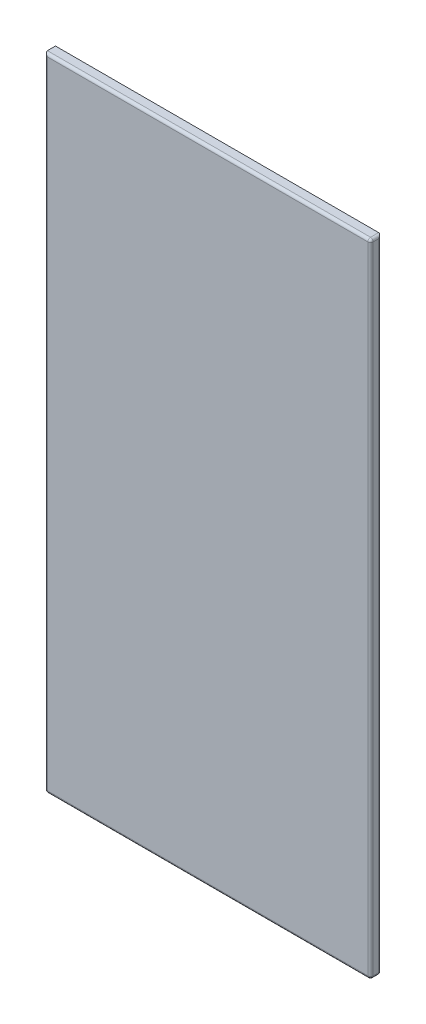
ISO-10303-21;
HEADER;
FILE_DESCRIPTION(('STEP AP214'),'2;1');
FILE_NAME('part.step','',(''),(''),'','','');
FILE_SCHEMA(('AUTOMOTIVE_DESIGN { 1 0 10303 214 1 1 1 1 }'));
ENDSEC;
DATA;
#1=APPLICATION_CONTEXT('core data for automotive mechanical design processes');
#2=APPLICATION_PROTOCOL_DEFINITION('international standard','automotive_design',2000,#1);
#3=PRODUCT_CONTEXT('',#1,'mechanical');
#4=PRODUCT('Part','Part','',(#3));
#5=PRODUCT_RELATED_PRODUCT_CATEGORY('part','',(#4));
#6=PRODUCT_DEFINITION_FORMATION('','',#4);
#7=PRODUCT_DEFINITION_CONTEXT('part definition',#1,'design');
#8=PRODUCT_DEFINITION('design','',#6,#7);
#9=PRODUCT_DEFINITION_SHAPE('','',#8);
#10=(LENGTH_UNIT() NAMED_UNIT(*) SI_UNIT(.MILLI.,.METRE.));
#11=(NAMED_UNIT(*) PLANE_ANGLE_UNIT() SI_UNIT($,.RADIAN.));
#12=(NAMED_UNIT(*) SI_UNIT($,.STERADIAN.) SOLID_ANGLE_UNIT());
#13=UNCERTAINTY_MEASURE_WITH_UNIT(LENGTH_MEASURE(1.E-05),#10,'distance_accuracy_value','');
#14=(GEOMETRIC_REPRESENTATION_CONTEXT(3) GLOBAL_UNCERTAINTY_ASSIGNED_CONTEXT((#13)) GLOBAL_UNIT_ASSIGNED_CONTEXT((#10,
#11,#12)) REPRESENTATION_CONTEXT('',''));
#15=CARTESIAN_POINT('',(0.,0.,0.));
#16=DIRECTION('',(0.,0.,1.));
#17=DIRECTION('',(1.,0.,0.));
#18=AXIS2_PLACEMENT_3D('',#15,#16,#17);
#19=CARTESIAN_POINT('',(302.5,595.,20.));
#20=DIRECTION('',(-1.,0.,0.));
#21=DIRECTION('',(0.,-1.,0.));
#22=AXIS2_PLACEMENT_3D('',#19,#20,#21);
#23=PLANE('',#22);
#24=DIRECTION('',(0.,1.,0.));
#25=VECTOR('',#24,1.);
#26=CARTESIAN_POINT('',(302.5,-595.,15.));
#27=LINE('',#26,#25);
#28=CARTESIAN_POINT('',(302.5,590.,15.));
#29=VERTEX_POINT('',#28);
#30=CARTESIAN_POINT('',(302.5,-590.,15.));
#31=VERTEX_POINT('',#30);
#32=EDGE_CURVE('E141',#29,#31,#27,.F.);
#33=ORIENTED_EDGE('',*,*,#32,.T.);
#34=DIRECTION('',(0.,0.,-1.));
#35=VECTOR('',#34,1.);
#36=CARTESIAN_POINT('',(302.5,-590.,20.));
#37=LINE('',#36,#35);
#38=CARTESIAN_POINT('',(302.5,-590.,5.));
#39=VERTEX_POINT('',#38);
#40=EDGE_CURVE('E148',#31,#39,#37,.T.);
#41=ORIENTED_EDGE('',*,*,#40,.T.);
#42=DIRECTION('',(0.,1.,0.));
#43=VECTOR('',#42,1.);
#44=CARTESIAN_POINT('',(302.5,595.,5.));
#45=LINE('',#44,#43);
#46=CARTESIAN_POINT('',(302.5,590.,5.));
#47=VERTEX_POINT('',#46);
#48=EDGE_CURVE('E144',#39,#47,#45,.T.);
#49=ORIENTED_EDGE('',*,*,#48,.T.);
#50=DIRECTION('',(0.,0.,-1.));
#51=VECTOR('',#50,1.);
#52=CARTESIAN_POINT('',(302.5,590.,20.));
#53=LINE('',#52,#51);
#54=EDGE_CURVE('E121',#47,#29,#53,.F.);
#55=ORIENTED_EDGE('',*,*,#54,.T.);
#56=EDGE_LOOP('',(#33,#41,#49,#55));
#57=FACE_BOUND('',#56,.T.);
#58=ADVANCED_FACE('F39',(#57),#23,.F.);
#59=CARTESIAN_POINT('',(-302.5,595.,20.));
#60=DIRECTION('',(0.,-1.,0.));
#61=DIRECTION('',(0.,0.,-1.));
#62=AXIS2_PLACEMENT_3D('',#59,#60,#61);
#63=PLANE('',#62);
#64=DIRECTION('',(0.,0.,-1.));
#65=VECTOR('',#64,1.);
#66=CARTESIAN_POINT('',(-302.5,595.,20.));
#67=LINE('',#66,#65);
#68=CARTESIAN_POINT('',(-302.5,595.,15.));
#69=VERTEX_POINT('',#68);
#70=CARTESIAN_POINT('',(-302.5,595.,0.));
#71=VERTEX_POINT('',#70);
#72=EDGE_CURVE('E113',#69,#71,#67,.T.);
#73=ORIENTED_EDGE('',*,*,#72,.F.);
#74=DIRECTION('',(-1.,0.,0.));
#75=VECTOR('',#74,1.);
#76=CARTESIAN_POINT('',(302.5,595.,15.));
#77=LINE('',#76,#75);
#78=CARTESIAN_POINT('',(297.5,595.,15.));
#79=VERTEX_POINT('',#78);
#80=EDGE_CURVE('E63',#69,#79,#77,.F.);
#81=ORIENTED_EDGE('',*,*,#80,.T.);
#82=DIRECTION('',(0.,0.,-1.));
#83=VECTOR('',#82,1.);
#84=CARTESIAN_POINT('',(297.5,595.,20.));
#85=LINE('',#84,#83);
#86=CARTESIAN_POINT('',(297.5,595.,0.));
#87=VERTEX_POINT('',#86);
#88=EDGE_CURVE('E127',#79,#87,#85,.T.);
#89=ORIENTED_EDGE('',*,*,#88,.T.);
#90=DIRECTION('',(-1.,0.,0.));
#91=VECTOR('',#90,1.);
#92=CARTESIAN_POINT('',(-302.5,595.,0.));
#93=LINE('',#92,#91);
#94=EDGE_CURVE('E124',#87,#71,#93,.T.);
#95=ORIENTED_EDGE('',*,*,#94,.T.);
#96=EDGE_LOOP('',(#73,#81,#89,#95));
#97=FACE_BOUND('',#96,.T.);
#98=ADVANCED_FACE('F125',(#97),#63,.F.);
#99=CARTESIAN_POINT('',(-302.5,595.,20.));
#100=DIRECTION('',(1.,0.,0.));
#101=DIRECTION('',(0.,1.,0.));
#102=AXIS2_PLACEMENT_3D('',#99,#100,#101);
#103=PLANE('',#102);
#104=DIRECTION('',(0.,0.,-1.));
#105=VECTOR('',#104,1.);
#106=CARTESIAN_POINT('',(-302.5,-590.,20.));
#107=LINE('',#106,#105);
#108=CARTESIAN_POINT('',(-302.5,-590.,0.));
#109=VERTEX_POINT('',#108);
#110=CARTESIAN_POINT('',(-302.5,-590.,15.));
#111=VERTEX_POINT('',#110);
#112=EDGE_CURVE('E49',#109,#111,#107,.F.);
#113=ORIENTED_EDGE('',*,*,#112,.T.);
#114=DIRECTION('',(0.,-1.,0.));
#115=VECTOR('',#114,1.);
#116=CARTESIAN_POINT('',(-302.5,595.,15.));
#117=LINE('',#116,#115);
#118=EDGE_CURVE('E11',#111,#69,#117,.F.);
#119=ORIENTED_EDGE('',*,*,#118,.T.);
#120=ORIENTED_EDGE('',*,*,#72,.T.);
#121=DIRECTION('',(0.,-1.,0.));
#122=VECTOR('',#121,1.);
#123=CARTESIAN_POINT('',(-302.5,595.,0.));
#124=LINE('',#123,#122);
#125=EDGE_CURVE('E117',#71,#109,#124,.T.);
#126=ORIENTED_EDGE('',*,*,#125,.T.);
#127=EDGE_LOOP('',(#113,#119,#120,#126));
#128=FACE_BOUND('',#127,.T.);
#129=ADVANCED_FACE('F115',(#128),#103,.F.);
#130=CARTESIAN_POINT('',(-302.5,-595.,20.));
#131=DIRECTION('',(0.,1.,0.));
#132=DIRECTION('',(0.,0.,1.));
#133=AXIS2_PLACEMENT_3D('',#130,#131,#132);
#134=PLANE('',#133);
#135=DIRECTION('',(1.,0.,0.));
#136=VECTOR('',#135,1.);
#137=CARTESIAN_POINT('',(-302.5,-595.,5.));
#138=LINE('',#137,#136);
#139=CARTESIAN_POINT('',(-297.5,-595.,5.));
#140=VERTEX_POINT('',#139);
#141=CARTESIAN_POINT('',(297.5,-595.,5.));
#142=VERTEX_POINT('',#141);
#143=EDGE_CURVE('E162',#140,#142,#138,.T.);
#144=ORIENTED_EDGE('',*,*,#143,.T.);
#145=DIRECTION('',(0.,0.,-1.));
#146=VECTOR('',#145,1.);
#147=CARTESIAN_POINT('',(297.5,-595.,20.));
#148=LINE('',#147,#146);
#149=CARTESIAN_POINT('',(297.5,-595.,15.));
#150=VERTEX_POINT('',#149);
#151=EDGE_CURVE('E166',#142,#150,#148,.F.);
#152=ORIENTED_EDGE('',*,*,#151,.T.);
#153=DIRECTION('',(1.,0.,0.));
#154=VECTOR('',#153,1.);
#155=CARTESIAN_POINT('',(-302.5,-595.,15.));
#156=LINE('',#155,#154);
#157=CARTESIAN_POINT('',(-297.5,-595.,15.));
#158=VERTEX_POINT('',#157);
#159=EDGE_CURVE('E159',#150,#158,#156,.F.);
#160=ORIENTED_EDGE('',*,*,#159,.T.);
#161=DIRECTION('',(0.,0.,-1.));
#162=VECTOR('',#161,1.);
#163=CARTESIAN_POINT('',(-297.5,-595.,20.));
#164=LINE('',#163,#162);
#165=EDGE_CURVE('E156',#158,#140,#164,.T.);
#166=ORIENTED_EDGE('',*,*,#165,.T.);
#167=EDGE_LOOP('',(#144,#152,#160,#166));
#168=FACE_BOUND('',#167,.T.);
#169=ADVANCED_FACE('F256',(#168),#134,.F.);
#170=CARTESIAN_POINT('',(0.,0.,20.));
#171=DIRECTION('',(0.,0.,1.));
#172=DIRECTION('',(1.,0.,0.));
#173=AXIS2_PLACEMENT_3D('',#170,#171,#172);
#174=PLANE('',#173);
#175=DIRECTION('',(1.,0.,0.));
#176=VECTOR('',#175,1.);
#177=CARTESIAN_POINT('',(302.5,-590.,20.));
#178=LINE('',#177,#176);
#179=CARTESIAN_POINT('',(-297.5,-590.,20.));
#180=VERTEX_POINT('',#179);
#181=CARTESIAN_POINT('',(297.5,-590.,20.));
#182=VERTEX_POINT('',#181);
#183=EDGE_CURVE('E169',#180,#182,#178,.T.);
#184=ORIENTED_EDGE('',*,*,#183,.T.);
#185=DIRECTION('',(0.,1.,0.));
#186=VECTOR('',#185,1.);
#187=CARTESIAN_POINT('',(297.5,595.,20.));
#188=LINE('',#187,#186);
#189=CARTESIAN_POINT('',(297.5,590.,20.));
#190=VERTEX_POINT('',#189);
#191=EDGE_CURVE('E178',#182,#190,#188,.T.);
#192=ORIENTED_EDGE('',*,*,#191,.T.);
#193=DIRECTION('',(-1.,0.,0.));
#194=VECTOR('',#193,1.);
#195=CARTESIAN_POINT('',(-302.5,590.,20.));
#196=LINE('',#195,#194);
#197=CARTESIAN_POINT('',(-297.5,590.,20.));
#198=VERTEX_POINT('',#197);
#199=EDGE_CURVE('E175',#190,#198,#196,.T.);
#200=ORIENTED_EDGE('',*,*,#199,.T.);
#201=DIRECTION('',(0.,-1.,0.));
#202=VECTOR('',#201,1.);
#203=CARTESIAN_POINT('',(-297.5,-595.,20.));
#204=LINE('',#203,#202);
#205=EDGE_CURVE('E172',#198,#180,#204,.T.);
#206=ORIENTED_EDGE('',*,*,#205,.T.);
#207=EDGE_LOOP('',(#184,#192,#200,#206));
#208=FACE_BOUND('',#207,.T.);
#209=ADVANCED_FACE('F274',(#208),#174,.T.);
#210=CARTESIAN_POINT('',(0.,0.,0.));
#211=DIRECTION('',(0.,0.,1.));
#212=DIRECTION('',(1.,0.,0.));
#213=AXIS2_PLACEMENT_3D('',#210,#211,#212);
#214=PLANE('',#213);
#215=ORIENTED_EDGE('',*,*,#94,.F.);
#216=DIRECTION('',(0.,1.,0.));
#217=VECTOR('',#216,1.);
#218=CARTESIAN_POINT('',(297.5,0.,0.));
#219=LINE('',#218,#217);
#220=CARTESIAN_POINT('',(297.5,-590.,0.));
#221=VERTEX_POINT('',#220);
#222=EDGE_CURVE('E153',#87,#221,#219,.F.);
#223=ORIENTED_EDGE('',*,*,#222,.T.);
#224=DIRECTION('',(1.,0.,0.));
#225=VECTOR('',#224,1.);
#226=CARTESIAN_POINT('',(0.,-590.,0.));
#227=LINE('',#226,#225);
#228=EDGE_CURVE('E135',#221,#109,#227,.F.);
#229=ORIENTED_EDGE('',*,*,#228,.T.);
#230=ORIENTED_EDGE('',*,*,#125,.F.);
#231=EDGE_LOOP('',(#215,#223,#229,#230));
#232=FACE_BOUND('',#231,.T.);
#233=ADVANCED_FACE('F133',(#232),#214,.F.);
#234=CARTESIAN_POINT('',(-297.5,-590.,15.));
#235=DIRECTION('',(0.,0.,1.));
#236=DIRECTION('',(1.,0.,0.));
#237=AXIS2_PLACEMENT_3D('',#234,#235,#236);
#238=SPHERICAL_SURFACE('',#237,5.);
#239=CARTESIAN_POINT('',(-297.5,-590.,15.));
#240=DIRECTION('',(0.,0.,1.));
#241=DIRECTION('',(1.,0.,0.));
#242=AXIS2_PLACEMENT_3D('',#239,#240,#241);
#243=CIRCLE('',#242,5.);
#244=EDGE_CURVE('E232',#158,#111,#243,.F.);
#245=ORIENTED_EDGE('',*,*,#244,.F.);
#246=CARTESIAN_POINT('',(-297.5,-590.,15.));
#247=DIRECTION('',(-1.,0.,0.));
#248=DIRECTION('',(0.,0.,1.));
#249=AXIS2_PLACEMENT_3D('',#246,#247,#248);
#250=CIRCLE('',#249,5.);
#251=EDGE_CURVE('E43',#180,#158,#250,.F.);
#252=ORIENTED_EDGE('',*,*,#251,.F.);
#253=CARTESIAN_POINT('',(-297.5,-590.,15.));
#254=DIRECTION('',(0.,-1.,0.));
#255=DIRECTION('',(0.,0.,-1.));
#256=AXIS2_PLACEMENT_3D('',#253,#254,#255);
#257=CIRCLE('',#256,5.);
#258=EDGE_CURVE('E234',#111,#180,#257,.F.);
#259=ORIENTED_EDGE('',*,*,#258,.F.);
#260=EDGE_LOOP('',(#245,#252,#259));
#261=FACE_BOUND('',#260,.T.);
#262=ADVANCED_FACE('F41',(#261),#238,.T.);
#263=CARTESIAN_POINT('',(0.,-590.,15.));
#264=DIRECTION('',(-1.,0.,0.));
#265=DIRECTION('',(0.,0.,1.));
#266=AXIS2_PLACEMENT_3D('',#263,#264,#265);
#267=CYLINDRICAL_SURFACE('',#266,5.);
#268=ORIENTED_EDGE('',*,*,#251,.T.);
#269=ORIENTED_EDGE('',*,*,#159,.F.);
#270=CARTESIAN_POINT('',(297.5,-590.,15.));
#271=DIRECTION('',(1.,0.,0.));
#272=DIRECTION('',(0.,0.,-1.));
#273=AXIS2_PLACEMENT_3D('',#270,#271,#272);
#274=CIRCLE('',#273,5.);
#275=EDGE_CURVE('E228',#182,#150,#274,.T.);
#276=ORIENTED_EDGE('',*,*,#275,.F.);
#277=ORIENTED_EDGE('',*,*,#183,.F.);
#278=EDGE_LOOP('',(#268,#269,#276,#277));
#279=FACE_BOUND('',#278,.T.);
#280=ADVANCED_FACE('F247',(#279),#267,.T.);
#281=CARTESIAN_POINT('',(-297.5,0.,15.));
#282=DIRECTION('',(0.,1.,0.));
#283=DIRECTION('',(-1.,0.,0.));
#284=AXIS2_PLACEMENT_3D('',#281,#282,#283);
#285=CYLINDRICAL_SURFACE('',#284,5.);
#286=ORIENTED_EDGE('',*,*,#258,.T.);
#287=ORIENTED_EDGE('',*,*,#205,.F.);
#288=CARTESIAN_POINT('',(-297.5,590.,15.));
#289=DIRECTION('',(0.707106781186547,0.707106781186548,0.));
#290=DIRECTION('',(-0.707106781186547,0.707106781186547,0.));
#291=AXIS2_PLACEMENT_3D('',#288,#289,#290);
#292=ELLIPSE('',#291,7.07106781186548,5.);
#293=EDGE_CURVE('E220',#69,#198,#292,.T.);
#294=ORIENTED_EDGE('',*,*,#293,.F.);
#295=ORIENTED_EDGE('',*,*,#118,.F.);
#296=EDGE_LOOP('',(#286,#287,#294,#295));
#297=FACE_BOUND('',#296,.T.);
#298=ADVANCED_FACE('F275',(#297),#285,.T.);
#299=CARTESIAN_POINT('',(-297.5,-590.,20.));
#300=DIRECTION('',(0.,0.,-1.));
#301=DIRECTION('',(-1.,0.,0.));
#302=AXIS2_PLACEMENT_3D('',#299,#300,#301);
#303=CYLINDRICAL_SURFACE('',#302,5.);
#304=ORIENTED_EDGE('',*,*,#244,.T.);
#305=ORIENTED_EDGE('',*,*,#112,.F.);
#306=CARTESIAN_POINT('',(-297.5,-590.,5.));
#307=DIRECTION('',(0.707106781186547,0.,-0.707106781186547));
#308=DIRECTION('',(-0.707106781186547,0.,-0.707106781186547));
#309=AXIS2_PLACEMENT_3D('',#306,#307,#308);
#310=ELLIPSE('',#309,7.07106781186547,5.);
#311=EDGE_CURVE('E216',#140,#109,#310,.T.);
#312=ORIENTED_EDGE('',*,*,#311,.F.);
#313=ORIENTED_EDGE('',*,*,#165,.F.);
#314=EDGE_LOOP('',(#304,#305,#312,#313));
#315=FACE_BOUND('',#314,.T.);
#316=ADVANCED_FACE('F253',(#315),#303,.T.);
#317=CARTESIAN_POINT('',(297.5,-590.,15.));
#318=DIRECTION('',(0.,0.,1.));
#319=DIRECTION('',(1.,0.,0.));
#320=AXIS2_PLACEMENT_3D('',#317,#318,#319);
#321=SPHERICAL_SURFACE('',#320,5.);
#322=CARTESIAN_POINT('',(297.5,-590.,15.));
#323=DIRECTION('',(0.,0.,1.));
#324=DIRECTION('',(1.,0.,0.));
#325=AXIS2_PLACEMENT_3D('',#322,#323,#324);
#326=CIRCLE('',#325,5.);
#327=EDGE_CURVE('E212',#31,#150,#326,.F.);
#328=ORIENTED_EDGE('',*,*,#327,.F.);
#329=CARTESIAN_POINT('',(297.5,-590.,15.));
#330=DIRECTION('',(0.,-1.,0.));
#331=DIRECTION('',(0.,0.,-1.));
#332=AXIS2_PLACEMENT_3D('',#329,#330,#331);
#333=CIRCLE('',#332,5.);
#334=EDGE_CURVE('E224',#182,#31,#333,.F.);
#335=ORIENTED_EDGE('',*,*,#334,.F.);
#336=ORIENTED_EDGE('',*,*,#275,.T.);
#337=EDGE_LOOP('',(#328,#335,#336));
#338=FACE_BOUND('',#337,.T.);
#339=ADVANCED_FACE('F266',(#338),#321,.T.);
#340=CARTESIAN_POINT('',(297.5,0.,15.));
#341=DIRECTION('',(0.,-1.,0.));
#342=DIRECTION('',(1.,0.,0.));
#343=AXIS2_PLACEMENT_3D('',#340,#341,#342);
#344=CYLINDRICAL_SURFACE('',#343,5.);
#345=ORIENTED_EDGE('',*,*,#334,.T.);
#346=ORIENTED_EDGE('',*,*,#32,.F.);
#347=CARTESIAN_POINT('',(297.5,590.,15.));
#348=DIRECTION('',(0.,1.,0.));
#349=DIRECTION('',(0.,0.,1.));
#350=AXIS2_PLACEMENT_3D('',#347,#348,#349);
#351=CIRCLE('',#350,5.);
#352=EDGE_CURVE('E208',#190,#29,#351,.T.);
#353=ORIENTED_EDGE('',*,*,#352,.F.);
#354=ORIENTED_EDGE('',*,*,#191,.F.);
#355=EDGE_LOOP('',(#345,#346,#353,#354));
#356=FACE_BOUND('',#355,.T.);
#357=ADVANCED_FACE('F271',(#356),#344,.T.);
#358=CARTESIAN_POINT('',(0.,590.,15.));
#359=DIRECTION('',(1.,0.,0.));
#360=DIRECTION('',(0.,0.,-1.));
#361=AXIS2_PLACEMENT_3D('',#358,#359,#360);
#362=CYLINDRICAL_SURFACE('',#361,5.);
#363=ORIENTED_EDGE('',*,*,#293,.T.);
#364=ORIENTED_EDGE('',*,*,#199,.F.);
#365=CARTESIAN_POINT('',(297.5,590.,15.));
#366=DIRECTION('',(1.,0.,0.));
#367=DIRECTION('',(0.,0.,-1.));
#368=AXIS2_PLACEMENT_3D('',#365,#366,#367);
#369=CIRCLE('',#368,5.);
#370=EDGE_CURVE('E205',#79,#190,#369,.T.);
#371=ORIENTED_EDGE('',*,*,#370,.F.);
#372=ORIENTED_EDGE('',*,*,#80,.F.);
#373=EDGE_LOOP('',(#363,#364,#371,#372));
#374=FACE_BOUND('',#373,.T.);
#375=ADVANCED_FACE('F277',(#374),#362,.T.);
#376=CARTESIAN_POINT('',(-302.5,-590.,5.));
#377=DIRECTION('',(1.,0.,0.));
#378=DIRECTION('',(0.,0.,-1.));
#379=AXIS2_PLACEMENT_3D('',#376,#377,#378);
#380=CYLINDRICAL_SURFACE('',#379,5.);
#381=ORIENTED_EDGE('',*,*,#311,.T.);
#382=ORIENTED_EDGE('',*,*,#228,.F.);
#383=CARTESIAN_POINT('',(297.5,-590.,5.));
#384=DIRECTION('',(1.,0.,0.));
#385=DIRECTION('',(0.,0.,-1.));
#386=AXIS2_PLACEMENT_3D('',#383,#384,#385);
#387=CIRCLE('',#386,5.);
#388=EDGE_CURVE('E201',#142,#221,#387,.T.);
#389=ORIENTED_EDGE('',*,*,#388,.F.);
#390=ORIENTED_EDGE('',*,*,#143,.F.);
#391=EDGE_LOOP('',(#381,#382,#389,#390));
#392=FACE_BOUND('',#391,.T.);
#393=ADVANCED_FACE('F292',(#392),#380,.T.);
#394=CARTESIAN_POINT('',(297.5,-590.,20.));
#395=DIRECTION('',(0.,0.,-1.));
#396=DIRECTION('',(-1.,0.,0.));
#397=AXIS2_PLACEMENT_3D('',#394,#395,#396);
#398=CYLINDRICAL_SURFACE('',#397,5.);
#399=ORIENTED_EDGE('',*,*,#327,.T.);
#400=ORIENTED_EDGE('',*,*,#151,.F.);
#401=CARTESIAN_POINT('',(297.5,-590.,5.));
#402=DIRECTION('',(0.,0.,-1.));
#403=DIRECTION('',(-1.,0.,0.));
#404=AXIS2_PLACEMENT_3D('',#401,#402,#403);
#405=CIRCLE('',#404,5.);
#406=EDGE_CURVE('E198',#39,#142,#405,.T.);
#407=ORIENTED_EDGE('',*,*,#406,.F.);
#408=ORIENTED_EDGE('',*,*,#40,.F.);
#409=EDGE_LOOP('',(#399,#400,#407,#408));
#410=FACE_BOUND('',#409,.T.);
#411=ADVANCED_FACE('F260',(#410),#398,.T.);
#412=CARTESIAN_POINT('',(297.5,590.,15.));
#413=DIRECTION('',(0.,0.,1.));
#414=DIRECTION('',(1.,0.,0.));
#415=AXIS2_PLACEMENT_3D('',#412,#413,#414);
#416=SPHERICAL_SURFACE('',#415,5.);
#417=ORIENTED_EDGE('',*,*,#370,.T.);
#418=ORIENTED_EDGE('',*,*,#352,.T.);
#419=CARTESIAN_POINT('',(297.5,590.,15.));
#420=DIRECTION('',(0.,0.,1.));
#421=DIRECTION('',(1.,0.,0.));
#422=AXIS2_PLACEMENT_3D('',#419,#420,#421);
#423=CIRCLE('',#422,5.);
#424=EDGE_CURVE('E194',#79,#29,#423,.F.);
#425=ORIENTED_EDGE('',*,*,#424,.F.);
#426=EDGE_LOOP('',(#417,#418,#425));
#427=FACE_BOUND('',#426,.T.);
#428=ADVANCED_FACE('F280',(#427),#416,.T.);
#429=CARTESIAN_POINT('',(297.5,-590.,5.));
#430=DIRECTION('',(0.,-1.,0.));
#431=DIRECTION('',(0.,0.,-1.));
#432=AXIS2_PLACEMENT_3D('',#429,#430,#431);
#433=SPHERICAL_SURFACE('',#432,5.);
#434=ORIENTED_EDGE('',*,*,#406,.T.);
#435=ORIENTED_EDGE('',*,*,#388,.T.);
#436=CARTESIAN_POINT('',(297.5,-590.,5.));
#437=DIRECTION('',(0.,-1.,0.));
#438=DIRECTION('',(1.,0.,0.));
#439=AXIS2_PLACEMENT_3D('',#436,#437,#438);
#440=CIRCLE('',#439,5.);
#441=EDGE_CURVE('E191',#39,#221,#440,.F.);
#442=ORIENTED_EDGE('',*,*,#441,.F.);
#443=EDGE_LOOP('',(#434,#435,#442));
#444=FACE_BOUND('',#443,.T.);
#445=ADVANCED_FACE('F290',(#444),#433,.T.);
#446=CARTESIAN_POINT('',(297.5,590.,20.));
#447=DIRECTION('',(0.,0.,-1.));
#448=DIRECTION('',(-1.,0.,0.));
#449=AXIS2_PLACEMENT_3D('',#446,#447,#448);
#450=CYLINDRICAL_SURFACE('',#449,5.);
#451=ORIENTED_EDGE('',*,*,#424,.T.);
#452=ORIENTED_EDGE('',*,*,#54,.F.);
#453=CARTESIAN_POINT('',(297.5,590.,5.));
#454=DIRECTION('',(0.,-0.707106781186547,-0.707106781186547));
#455=DIRECTION('',(0.,0.707106781186547,-0.707106781186547));
#456=AXIS2_PLACEMENT_3D('',#453,#454,#455);
#457=ELLIPSE('',#456,7.07106781186547,5.);
#458=EDGE_CURVE('E188',#87,#47,#457,.T.);
#459=ORIENTED_EDGE('',*,*,#458,.F.);
#460=ORIENTED_EDGE('',*,*,#88,.F.);
#461=EDGE_LOOP('',(#451,#452,#459,#460));
#462=FACE_BOUND('',#461,.T.);
#463=ADVANCED_FACE('F284',(#462),#450,.T.);
#464=CARTESIAN_POINT('',(297.5,595.,5.));
#465=DIRECTION('',(0.,1.,0.));
#466=DIRECTION('',(-1.,0.,0.));
#467=AXIS2_PLACEMENT_3D('',#464,#465,#466);
#468=CYLINDRICAL_SURFACE('',#467,5.);
#469=ORIENTED_EDGE('',*,*,#441,.T.);
#470=ORIENTED_EDGE('',*,*,#222,.F.);
#471=ORIENTED_EDGE('',*,*,#458,.T.);
#472=ORIENTED_EDGE('',*,*,#48,.F.);
#473=EDGE_LOOP('',(#469,#470,#471,#472));
#474=FACE_BOUND('',#473,.T.);
#475=ADVANCED_FACE('F287',(#474),#468,.T.);
#476=CLOSED_SHELL('',(#58,#98,#129,#169,#209,#233,#262,#280,#298,#316,#339,#357,#375,#393,#411,
#428,#445,#463,#475));
#477=MANIFOLD_SOLID_BREP('B2',#476);
#478=ADVANCED_BREP_SHAPE_REPRESENTATION('',(#18,#477),#14);
#479=SHAPE_DEFINITION_REPRESENTATION(#9,#478);
ENDSEC;
END-ISO-10303-21;
